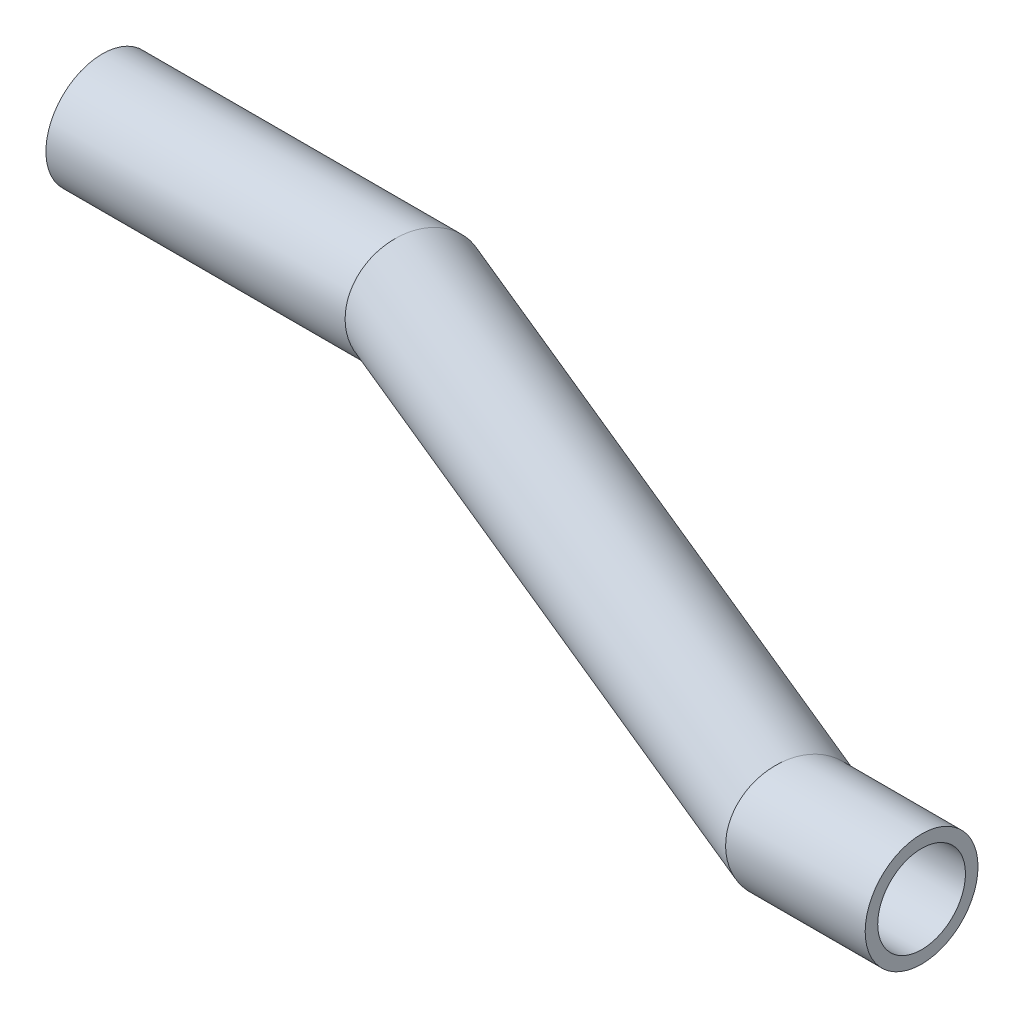
ISO-10303-21;
HEADER;
FILE_DESCRIPTION(('STEP AP214'),'2;1');
FILE_NAME('part.step','',(''),(''),'','','');
FILE_SCHEMA(('AUTOMOTIVE_DESIGN { 1 0 10303 214 1 1 1 1 }'));
ENDSEC;
DATA;
#1=APPLICATION_CONTEXT('core data for automotive mechanical design processes');
#2=APPLICATION_PROTOCOL_DEFINITION('international standard','automotive_design',2000,#1);
#3=PRODUCT_CONTEXT('',#1,'mechanical');
#4=PRODUCT('Part','Part','',(#3));
#5=PRODUCT_RELATED_PRODUCT_CATEGORY('part','',(#4));
#6=PRODUCT_DEFINITION_FORMATION('','',#4);
#7=PRODUCT_DEFINITION_CONTEXT('part definition',#1,'design');
#8=PRODUCT_DEFINITION('design','',#6,#7);
#9=PRODUCT_DEFINITION_SHAPE('','',#8);
#10=(LENGTH_UNIT() NAMED_UNIT(*) SI_UNIT(.MILLI.,.METRE.));
#11=(NAMED_UNIT(*) PLANE_ANGLE_UNIT() SI_UNIT($,.RADIAN.));
#12=(NAMED_UNIT(*) SI_UNIT($,.STERADIAN.) SOLID_ANGLE_UNIT());
#13=UNCERTAINTY_MEASURE_WITH_UNIT(LENGTH_MEASURE(1.E-05),#10,'distance_accuracy_value','');
#14=(GEOMETRIC_REPRESENTATION_CONTEXT(3) GLOBAL_UNCERTAINTY_ASSIGNED_CONTEXT((#13)) GLOBAL_UNIT_ASSIGNED_CONTEXT((#10,
#11,#12)) REPRESENTATION_CONTEXT('',''));
#15=CARTESIAN_POINT('',(0.,0.,0.));
#16=DIRECTION('',(0.,0.,1.));
#17=DIRECTION('',(1.,0.,0.));
#18=AXIS2_PLACEMENT_3D('',#15,#16,#17);
#19=CARTESIAN_POINT('',(2.27708238838201,0.,0.));
#20=DIRECTION('',(-1.,0.,0.));
#21=DIRECTION('',(0.,0.,1.));
#22=AXIS2_PLACEMENT_3D('',#19,#20,#21);
#23=CYLINDRICAL_SURFACE('',#22,4.5);
#24=CARTESIAN_POINT('',(0.,0.,0.));
#25=DIRECTION('',(-0.966471442595059,-0.0928310103208486,-0.239406253408376));
#26=DIRECTION('',(0.2567741237902,-0.349406393206711,-0.901100561390377));
#27=AXIS2_PLACEMENT_3D('',#24,#25,#26);
#28=ELLIPSE('',#27,4.656112743401,4.5);
#29=CARTESIAN_POINT('',(1.19556926995519,-1.62687556003554,-4.19562580697552));
#30=VERTEX_POINT('',#29);
#31=EDGE_CURVE('E38',#30,#30,#28,.T.);
#32=ORIENTED_EDGE('',*,*,#31,.T.);
#33=EDGE_LOOP('',(#32));
#34=FACE_BOUND('',#33,.T.);
#35=CARTESIAN_POINT('',(-25.,0.,0.));
#36=DIRECTION('',(1.,0.,0.));
#37=DIRECTION('',(0.,0.,-1.));
#38=AXIS2_PLACEMENT_3D('',#35,#36,#37);
#39=CIRCLE('',#38,4.5);
#40=CARTESIAN_POINT('',(-25.,0.,-4.5));
#41=VERTEX_POINT('',#40);
#42=EDGE_CURVE('E49',#41,#41,#39,.T.);
#43=ORIENTED_EDGE('',*,*,#42,.T.);
#44=EDGE_LOOP('',(#43));
#45=FACE_BOUND('',#44,.T.);
#46=ADVANCED_FACE('F35',(#34,#45),#23,.T.);
#47=CARTESIAN_POINT('',(66.9768128669117,13.843622925713,35.7019694904572));
#48=DIRECTION('',(-0.86813409870355,-0.179437040924695,-0.462758614195743));
#49=DIRECTION('',(-0.470393352822825,0.,0.882456850854534));
#50=AXIS2_PLACEMENT_3D('',#47,#48,#49);
#51=CYLINDRICAL_SURFACE('',#50,4.5);
#52=CARTESIAN_POINT('',(65.,13.43503,34.64823));
#53=DIRECTION('',(-0.966471442595059,-0.0928310103208486,-0.239406253408376));
#54=DIRECTION('',(-0.2567741237902,0.349406393206711,0.901100561390377));
#55=AXIS2_PLACEMENT_3D('',#52,#53,#54);
#56=ELLIPSE('',#55,4.656112743401,4.5);
#57=CARTESIAN_POINT('',(63.8044307300448,15.0619055600356,38.8438558069755));
#58=VERTEX_POINT('',#57);
#59=EDGE_CURVE('E87',#58,#58,#56,.T.);
#60=ORIENTED_EDGE('',*,*,#59,.T.);
#61=EDGE_LOOP('',(#60));
#62=FACE_BOUND('',#61,.T.);
#63=ORIENTED_EDGE('',*,*,#31,.F.);
#64=EDGE_LOOP('',(#63));
#65=FACE_BOUND('',#64,.T.);
#66=ADVANCED_FACE('F93',(#62,#65),#51,.T.);
#67=CARTESIAN_POINT('',(75.,13.43503,34.64823));
#68=DIRECTION('',(-1.,0.,0.));
#69=DIRECTION('',(0.,0.,1.));
#70=AXIS2_PLACEMENT_3D('',#67,#68,#69);
#71=CYLINDRICAL_SURFACE('',#70,4.5);
#72=CARTESIAN_POINT('',(75.,13.43503,34.64823));
#73=DIRECTION('',(1.,0.,0.));
#74=DIRECTION('',(0.,0.,-1.));
#75=AXIS2_PLACEMENT_3D('',#72,#73,#74);
#76=CIRCLE('',#75,4.5);
#77=CARTESIAN_POINT('',(75.,13.43503,30.14823));
#78=VERTEX_POINT('',#77);
#79=EDGE_CURVE('E55',#78,#78,#76,.T.);
#80=ORIENTED_EDGE('',*,*,#79,.F.);
#81=EDGE_LOOP('',(#80));
#82=FACE_BOUND('',#81,.T.);
#83=ORIENTED_EDGE('',*,*,#59,.F.);
#84=EDGE_LOOP('',(#83));
#85=FACE_BOUND('',#84,.T.);
#86=ADVANCED_FACE('F97',(#82,#85),#71,.T.);
#87=CARTESIAN_POINT('',(-25.,0.,0.));
#88=DIRECTION('',(1.,0.,0.));
#89=DIRECTION('',(0.,0.,-1.));
#90=AXIS2_PLACEMENT_3D('',#87,#88,#89);
#91=PLANE('',#90);
#92=CARTESIAN_POINT('',(-25.,0.,0.));
#93=DIRECTION('',(1.,0.,0.));
#94=DIRECTION('',(0.,0.,-1.));
#95=AXIS2_PLACEMENT_3D('',#92,#93,#94);
#96=CIRCLE('',#95,3.5);
#97=CARTESIAN_POINT('',(-25.,0.,-3.5));
#98=VERTEX_POINT('',#97);
#99=EDGE_CURVE('E80',#98,#98,#96,.F.);
#100=ORIENTED_EDGE('',*,*,#99,.F.);
#101=EDGE_LOOP('',(#100));
#102=FACE_BOUND('',#101,.T.);
#103=ORIENTED_EDGE('',*,*,#42,.F.);
#104=EDGE_LOOP('',(#103));
#105=FACE_BOUND('',#104,.T.);
#106=ADVANCED_FACE('F114',(#102,#105),#91,.F.);
#107=CARTESIAN_POINT('',(75.,13.43503,34.64823));
#108=DIRECTION('',(1.,0.,0.));
#109=DIRECTION('',(0.,0.,-1.));
#110=AXIS2_PLACEMENT_3D('',#107,#108,#109);
#111=PLANE('',#110);
#112=CARTESIAN_POINT('',(75.,13.43503,34.64823));
#113=DIRECTION('',(1.,0.,0.));
#114=DIRECTION('',(0.,0.,-1.));
#115=AXIS2_PLACEMENT_3D('',#112,#113,#114);
#116=CIRCLE('',#115,3.5);
#117=CARTESIAN_POINT('',(75.,13.43503,31.14823));
#118=VERTEX_POINT('',#117);
#119=EDGE_CURVE('E43',#118,#118,#116,.F.);
#120=ORIENTED_EDGE('',*,*,#119,.T.);
#121=EDGE_LOOP('',(#120));
#122=FACE_BOUND('',#121,.T.);
#123=ORIENTED_EDGE('',*,*,#79,.T.);
#124=EDGE_LOOP('',(#123));
#125=FACE_BOUND('',#124,.T.);
#126=ADVANCED_FACE('F111',(#122,#125),#111,.T.);
#127=CARTESIAN_POINT('',(1.7932863020749,0.,0.));
#128=DIRECTION('',(-1.,0.,0.));
#129=DIRECTION('',(0.,0.,1.));
#130=AXIS2_PLACEMENT_3D('',#127,#128,#129);
#131=CYLINDRICAL_SURFACE('',#130,3.5);
#132=CARTESIAN_POINT('',(0.,0.,0.));
#133=DIRECTION('',(-0.966471442595059,-0.0928310103208486,-0.239406253408376));
#134=DIRECTION('',(0.2567741237902,-0.349406393206711,-0.901100561390377));
#135=AXIS2_PLACEMENT_3D('',#132,#133,#134);
#136=ELLIPSE('',#135,3.62142102264522,3.5);
#137=CARTESIAN_POINT('',(0.929887209965151,-1.26534765780542,-3.26326451653651));
#138=VERTEX_POINT('',#137);
#139=EDGE_CURVE('E77',#138,#138,#136,.F.);
#140=ORIENTED_EDGE('',*,*,#139,.T.);
#141=EDGE_LOOP('',(#140));
#142=FACE_BOUND('',#141,.T.);
#143=ORIENTED_EDGE('',*,*,#99,.T.);
#144=EDGE_LOOP('',(#143));
#145=FACE_BOUND('',#144,.T.);
#146=ADVANCED_FACE('F105',(#142,#145),#131,.F.);
#147=CARTESIAN_POINT('',(66.5568129875692,13.7568119875751,35.4780886840044));
#148=DIRECTION('',(-0.86813409870355,-0.179437040924695,-0.462758614195743));
#149=DIRECTION('',(-0.470393352822825,0.,0.882456850854534));
#150=AXIS2_PLACEMENT_3D('',#147,#148,#149);
#151=CYLINDRICAL_SURFACE('',#150,3.5);
#152=CARTESIAN_POINT('',(65.,13.43503,34.64823));
#153=DIRECTION('',(-0.966471442595059,-0.0928310103208486,-0.239406253408376));
#154=DIRECTION('',(-0.2567741237902,0.349406393206711,0.901100561390377));
#155=AXIS2_PLACEMENT_3D('',#152,#153,#154);
#156=ELLIPSE('',#155,3.62142102264522,3.5);
#157=CARTESIAN_POINT('',(64.0701127900349,14.7003776578054,37.9114945165365));
#158=VERTEX_POINT('',#157);
#159=EDGE_CURVE('E11',#158,#158,#156,.F.);
#160=ORIENTED_EDGE('',*,*,#159,.T.);
#161=EDGE_LOOP('',(#160));
#162=FACE_BOUND('',#161,.T.);
#163=ORIENTED_EDGE('',*,*,#139,.F.);
#164=EDGE_LOOP('',(#163));
#165=FACE_BOUND('',#164,.T.);
#166=ADVANCED_FACE('F78',(#162,#165),#151,.F.);
#167=CARTESIAN_POINT('',(75.,13.43503,34.64823));
#168=DIRECTION('',(-1.,0.,0.));
#169=DIRECTION('',(0.,0.,1.));
#170=AXIS2_PLACEMENT_3D('',#167,#168,#169);
#171=CYLINDRICAL_SURFACE('',#170,3.5);
#172=ORIENTED_EDGE('',*,*,#119,.F.);
#173=EDGE_LOOP('',(#172));
#174=FACE_BOUND('',#173,.T.);
#175=ORIENTED_EDGE('',*,*,#159,.F.);
#176=EDGE_LOOP('',(#175));
#177=FACE_BOUND('',#176,.T.);
#178=ADVANCED_FACE('F98',(#174,#177),#171,.F.);
#179=CLOSED_SHELL('',(#46,#66,#86,#106,#126,#146,#166,#178));
#180=MANIFOLD_SOLID_BREP('B2',#179);
#181=ADVANCED_BREP_SHAPE_REPRESENTATION('',(#18,#180),#14);
#182=SHAPE_DEFINITION_REPRESENTATION(#9,#181);
ENDSEC;
END-ISO-10303-21;
